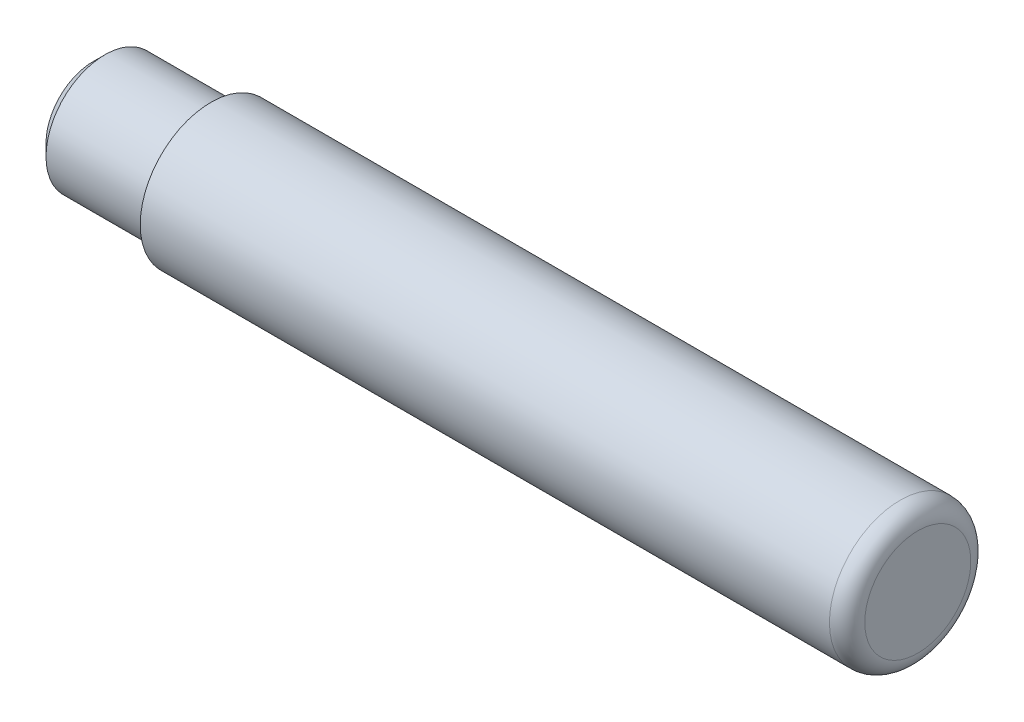
ISO-10303-21;
HEADER;
FILE_DESCRIPTION(('STEP AP214'),'2;1');
FILE_NAME('part.step','',(''),(''),'','','');
FILE_SCHEMA(('AUTOMOTIVE_DESIGN { 1 0 10303 214 1 1 1 1 }'));
ENDSEC;
DATA;
#1=APPLICATION_CONTEXT('core data for automotive mechanical design processes');
#2=APPLICATION_PROTOCOL_DEFINITION('international standard','automotive_design',2000,#1);
#3=PRODUCT_CONTEXT('',#1,'mechanical');
#4=PRODUCT('Part','Part','',(#3));
#5=PRODUCT_RELATED_PRODUCT_CATEGORY('part','',(#4));
#6=PRODUCT_DEFINITION_FORMATION('','',#4);
#7=PRODUCT_DEFINITION_CONTEXT('part definition',#1,'design');
#8=PRODUCT_DEFINITION('design','',#6,#7);
#9=PRODUCT_DEFINITION_SHAPE('','',#8);
#10=(LENGTH_UNIT() NAMED_UNIT(*) SI_UNIT(.MILLI.,.METRE.));
#11=(NAMED_UNIT(*) PLANE_ANGLE_UNIT() SI_UNIT($,.RADIAN.));
#12=(NAMED_UNIT(*) SI_UNIT($,.STERADIAN.) SOLID_ANGLE_UNIT());
#13=UNCERTAINTY_MEASURE_WITH_UNIT(LENGTH_MEASURE(1.E-05),#10,'distance_accuracy_value','');
#14=(GEOMETRIC_REPRESENTATION_CONTEXT(3) GLOBAL_UNCERTAINTY_ASSIGNED_CONTEXT((#13)) GLOBAL_UNIT_ASSIGNED_CONTEXT((#10,
#11,#12)) REPRESENTATION_CONTEXT('',''));
#15=CARTESIAN_POINT('',(0.,0.,0.));
#16=DIRECTION('',(0.,0.,1.));
#17=DIRECTION('',(1.,0.,0.));
#18=AXIS2_PLACEMENT_3D('',#15,#16,#17);
#19=CARTESIAN_POINT('',(0.,0.,0.));
#20=DIRECTION('',(-1.,0.,0.));
#21=DIRECTION('',(0.,0.,1.));
#22=AXIS2_PLACEMENT_3D('',#19,#20,#21);
#23=PLANE('',#22);
#24=CARTESIAN_POINT('',(0.,0.,0.));
#25=DIRECTION('',(-1.,0.,0.));
#26=DIRECTION('',(0.,0.,1.));
#27=AXIS2_PLACEMENT_3D('',#24,#25,#26);
#28=CIRCLE('',#27,4.5);
#29=CARTESIAN_POINT('',(0.,0.,4.5));
#30=VERTEX_POINT('',#29);
#31=EDGE_CURVE('E10',#30,#30,#28,.T.);
#32=ORIENTED_EDGE('',*,*,#31,.F.);
#33=EDGE_LOOP('',(#32));
#34=FACE_BOUND('',#33,.T.);
#35=ADVANCED_FACE('F33',(#34),#23,.F.);
#36=CARTESIAN_POINT('',(-1.5,0.,0.));
#37=DIRECTION('',(-1.,0.,0.));
#38=DIRECTION('',(0.,0.,1.));
#39=AXIS2_PLACEMENT_3D('',#36,#37,#38);
#40=TOROIDAL_SURFACE('',#39,4.5,1.5);
#41=CARTESIAN_POINT('',(-1.5,0.,0.));
#42=DIRECTION('',(-1.,0.,0.));
#43=DIRECTION('',(0.,0.,1.));
#44=AXIS2_PLACEMENT_3D('',#41,#42,#43);
#45=CIRCLE('',#44,6.);
#46=CARTESIAN_POINT('',(-1.5,0.,6.));
#47=VERTEX_POINT('',#46);
#48=EDGE_CURVE('E39',#47,#47,#45,.T.);
#49=ORIENTED_EDGE('',*,*,#48,.F.);
#50=EDGE_LOOP('',(#49));
#51=FACE_BOUND('',#50,.T.);
#52=ORIENTED_EDGE('',*,*,#31,.T.);
#53=EDGE_LOOP('',(#52));
#54=FACE_BOUND('',#53,.T.);
#55=ADVANCED_FACE('F81',(#51,#54),#40,.T.);
#56=CARTESIAN_POINT('',(-70.,0.,0.));
#57=DIRECTION('',(-1.,0.,0.));
#58=DIRECTION('',(0.,0.,1.));
#59=AXIS2_PLACEMENT_3D('',#56,#57,#58);
#60=CYLINDRICAL_SURFACE('',#59,6.);
#61=CARTESIAN_POINT('',(-60.,0.,0.));
#62=DIRECTION('',(-1.,0.,0.));
#63=DIRECTION('',(0.,0.,1.));
#64=AXIS2_PLACEMENT_3D('',#61,#62,#63);
#65=CIRCLE('',#64,5.99999999999999);
#66=CARTESIAN_POINT('',(-60.,0.,5.99999999999999));
#67=VERTEX_POINT('',#66);
#68=EDGE_CURVE('E43',#67,#67,#65,.T.);
#69=ORIENTED_EDGE('',*,*,#68,.F.);
#70=EDGE_LOOP('',(#69));
#71=FACE_BOUND('',#70,.T.);
#72=ORIENTED_EDGE('',*,*,#48,.T.);
#73=EDGE_LOOP('',(#72));
#74=FACE_BOUND('',#73,.T.);
#75=ADVANCED_FACE('F76',(#71,#74),#60,.T.);
#76=CARTESIAN_POINT('',(-60.,0.,0.));
#77=DIRECTION('',(1.,0.,0.));
#78=DIRECTION('',(0.,0.,-1.));
#79=AXIS2_PLACEMENT_3D('',#76,#77,#78);
#80=PLANE('',#79);
#81=CARTESIAN_POINT('',(-60.,0.,0.));
#82=DIRECTION('',(-1.,0.,0.));
#83=DIRECTION('',(0.,0.,1.));
#84=AXIS2_PLACEMENT_3D('',#81,#82,#83);
#85=CIRCLE('',#84,5.);
#86=CARTESIAN_POINT('',(-60.,0.,5.));
#87=VERTEX_POINT('',#86);
#88=EDGE_CURVE('E47',#87,#87,#85,.T.);
#89=ORIENTED_EDGE('',*,*,#88,.F.);
#90=EDGE_LOOP('',(#89));
#91=FACE_BOUND('',#90,.T.);
#92=ORIENTED_EDGE('',*,*,#68,.T.);
#93=EDGE_LOOP('',(#92));
#94=FACE_BOUND('',#93,.T.);
#95=ADVANCED_FACE('F70',(#91,#94),#80,.F.);
#96=CARTESIAN_POINT('',(-70.,0.,0.));
#97=DIRECTION('',(-1.,0.,0.));
#98=DIRECTION('',(0.,0.,1.));
#99=AXIS2_PLACEMENT_3D('',#96,#97,#98);
#100=CYLINDRICAL_SURFACE('',#99,5.);
#101=CARTESIAN_POINT('',(-69.,0.,0.));
#102=DIRECTION('',(-1.,0.,0.));
#103=DIRECTION('',(0.,0.,1.));
#104=AXIS2_PLACEMENT_3D('',#101,#102,#103);
#105=CIRCLE('',#104,5.);
#106=CARTESIAN_POINT('',(-69.,0.,5.));
#107=VERTEX_POINT('',#106);
#108=EDGE_CURVE('E52',#107,#107,#105,.T.);
#109=ORIENTED_EDGE('',*,*,#108,.F.);
#110=EDGE_LOOP('',(#109));
#111=FACE_BOUND('',#110,.T.);
#112=ORIENTED_EDGE('',*,*,#88,.T.);
#113=EDGE_LOOP('',(#112));
#114=FACE_BOUND('',#113,.T.);
#115=ADVANCED_FACE('F64',(#111,#114),#100,.T.);
#116=CARTESIAN_POINT('',(-69.,0.,0.));
#117=DIRECTION('',(1.,0.,0.));
#118=DIRECTION('',(0.,0.,-1.));
#119=AXIS2_PLACEMENT_3D('',#116,#117,#118);
#120=CONICAL_SURFACE('',#119,5.,0.785398163397448);
#121=CARTESIAN_POINT('',(-70.,0.,0.));
#122=DIRECTION('',(-1.,0.,0.));
#123=DIRECTION('',(0.,0.,1.));
#124=AXIS2_PLACEMENT_3D('',#121,#122,#123);
#125=CIRCLE('',#124,4.);
#126=CARTESIAN_POINT('',(-70.,0.,4.));
#127=VERTEX_POINT('',#126);
#128=EDGE_CURVE('E55',#127,#127,#125,.T.);
#129=ORIENTED_EDGE('',*,*,#128,.F.);
#130=EDGE_LOOP('',(#129));
#131=FACE_BOUND('',#130,.T.);
#132=ORIENTED_EDGE('',*,*,#108,.T.);
#133=EDGE_LOOP('',(#132));
#134=FACE_BOUND('',#133,.T.);
#135=ADVANCED_FACE('F61',(#131,#134),#120,.T.);
#136=CARTESIAN_POINT('',(-70.,0.,0.));
#137=DIRECTION('',(1.,0.,0.));
#138=DIRECTION('',(0.,0.,-1.));
#139=AXIS2_PLACEMENT_3D('',#136,#137,#138);
#140=PLANE('',#139);
#141=ORIENTED_EDGE('',*,*,#128,.T.);
#142=EDGE_LOOP('',(#141));
#143=FACE_BOUND('',#142,.T.);
#144=ADVANCED_FACE('F59',(#143),#140,.F.);
#145=CLOSED_SHELL('',(#35,#55,#75,#95,#115,#135,#144));
#146=MANIFOLD_SOLID_BREP('B2',#145);
#147=ADVANCED_BREP_SHAPE_REPRESENTATION('',(#18,#146),#14);
#148=SHAPE_DEFINITION_REPRESENTATION(#9,#147);
ENDSEC;
END-ISO-10303-21;
